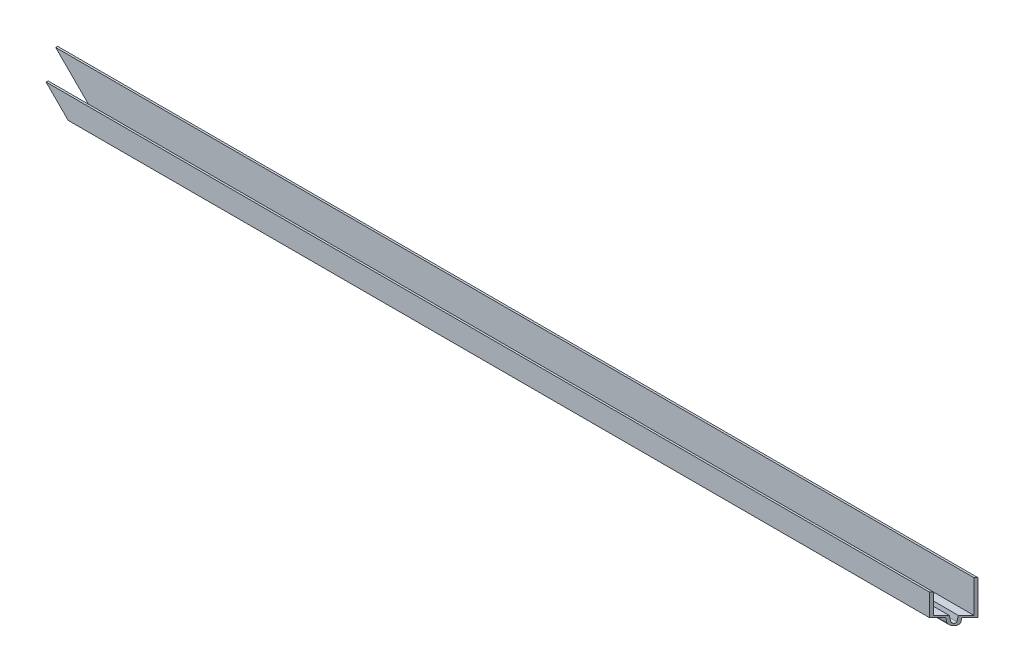
ISO-10303-21;
HEADER;
FILE_DESCRIPTION(('STEP AP214'),'2;1');
FILE_NAME('part.step','',(''),(''),'','','');
FILE_SCHEMA(('AUTOMOTIVE_DESIGN { 1 0 10303 214 1 1 1 1 }'));
ENDSEC;
DATA;
#1=APPLICATION_CONTEXT('core data for automotive mechanical design processes');
#2=APPLICATION_PROTOCOL_DEFINITION('international standard','automotive_design',2000,#1);
#3=PRODUCT_CONTEXT('',#1,'mechanical');
#4=PRODUCT('Part','Part','',(#3));
#5=PRODUCT_RELATED_PRODUCT_CATEGORY('part','',(#4));
#6=PRODUCT_DEFINITION_FORMATION('','',#4);
#7=PRODUCT_DEFINITION_CONTEXT('part definition',#1,'design');
#8=PRODUCT_DEFINITION('design','',#6,#7);
#9=PRODUCT_DEFINITION_SHAPE('','',#8);
#10=(LENGTH_UNIT() NAMED_UNIT(*) SI_UNIT(.MILLI.,.METRE.));
#11=(NAMED_UNIT(*) PLANE_ANGLE_UNIT() SI_UNIT($,.RADIAN.));
#12=(NAMED_UNIT(*) SI_UNIT($,.STERADIAN.) SOLID_ANGLE_UNIT());
#13=UNCERTAINTY_MEASURE_WITH_UNIT(LENGTH_MEASURE(1.E-05),#10,'distance_accuracy_value','');
#14=(GEOMETRIC_REPRESENTATION_CONTEXT(3) GLOBAL_UNCERTAINTY_ASSIGNED_CONTEXT((#13)) GLOBAL_UNIT_ASSIGNED_CONTEXT((#10,
#11,#12)) REPRESENTATION_CONTEXT('',''));
#15=CARTESIAN_POINT('',(0.,0.,0.));
#16=DIRECTION('',(0.,0.,1.));
#17=DIRECTION('',(1.,0.,0.));
#18=AXIS2_PLACEMENT_3D('',#15,#16,#17);
#19=CARTESIAN_POINT('',(289.71875,0.,-7.62));
#20=DIRECTION('',(0.,-1.,0.));
#21=DIRECTION('',(0.,0.,-1.));
#22=AXIS2_PLACEMENT_3D('',#19,#20,#21);
#23=PLANE('',#22);
#24=DIRECTION('',(-1.,0.,0.));
#25=VECTOR('',#24,1.);
#26=CARTESIAN_POINT('',(289.71875,0.,-6.35));
#27=LINE('',#26,#25);
#28=CARTESIAN_POINT('',(288.44875,0.,-6.35));
#29=VERTEX_POINT('',#28);
#30=CARTESIAN_POINT('',(-289.71875,0.,-6.35));
#31=VERTEX_POINT('',#30);
#32=EDGE_CURVE('E11',#29,#31,#27,.T.);
#33=ORIENTED_EDGE('',*,*,#32,.F.);
#34=DIRECTION('',(-0.707106781186547,0.,0.707106781186548));
#35=VECTOR('',#34,1.);
#36=CARTESIAN_POINT('',(289.71875,0.,-7.62));
#37=LINE('',#36,#35);
#38=CARTESIAN_POINT('',(289.71875,0.,-7.62));
#39=VERTEX_POINT('',#38);
#40=EDGE_CURVE('E176',#39,#29,#37,.T.);
#41=ORIENTED_EDGE('',*,*,#40,.F.);
#42=DIRECTION('',(-1.,0.,0.));
#43=VECTOR('',#42,1.);
#44=CARTESIAN_POINT('',(289.71875,0.,-7.62));
#45=LINE('',#44,#43);
#46=CARTESIAN_POINT('',(-289.71875,0.,-7.62));
#47=VERTEX_POINT('',#46);
#48=EDGE_CURVE('E170',#39,#47,#45,.T.);
#49=ORIENTED_EDGE('',*,*,#48,.T.);
#50=DIRECTION('',(0.,0.,1.));
#51=VECTOR('',#50,1.);
#52=CARTESIAN_POINT('',(-289.71875,0.,-7.62));
#53=LINE('',#52,#51);
#54=EDGE_CURVE('E152',#47,#31,#53,.T.);
#55=ORIENTED_EDGE('',*,*,#54,.T.);
#56=EDGE_LOOP('',(#33,#41,#49,#55));
#57=FACE_BOUND('',#56,.T.);
#58=ADVANCED_FACE('F45',(#57),#23,.F.);
#59=CARTESIAN_POINT('',(289.71875,0.,-6.35));
#60=DIRECTION('',(0.,0.,-1.));
#61=DIRECTION('',(-1.,0.,0.));
#62=AXIS2_PLACEMENT_3D('',#59,#60,#61);
#63=PLANE('',#62);
#64=ORIENTED_EDGE('',*,*,#32,.T.);
#65=DIRECTION('',(0.707106781186549,-0.707106781186546,0.));
#66=VECTOR('',#65,1.);
#67=CARTESIAN_POINT('',(8.88178419700125E-13,-289.71875,-6.35));
#68=LINE('',#67,#66);
#69=CARTESIAN_POINT('',(-269.14475,-20.574,-6.35));
#70=VERTEX_POINT('',#69);
#71=EDGE_CURVE('E158',#31,#70,#68,.T.);
#72=ORIENTED_EDGE('',*,*,#71,.T.);
#73=DIRECTION('',(-1.,0.,0.));
#74=VECTOR('',#73,1.);
#75=CARTESIAN_POINT('',(289.71875,-20.574,-6.35));
#76=LINE('',#75,#74);
#77=CARTESIAN_POINT('',(288.44875,-20.574,-6.35));
#78=VERTEX_POINT('',#77);
#79=EDGE_CURVE('E53',#78,#70,#76,.T.);
#80=ORIENTED_EDGE('',*,*,#79,.F.);
#81=DIRECTION('',(0.,1.,0.));
#82=VECTOR('',#81,1.);
#83=CARTESIAN_POINT('',(288.44875,0.,-6.35));
#84=LINE('',#83,#82);
#85=EDGE_CURVE('E163',#78,#29,#84,.T.);
#86=ORIENTED_EDGE('',*,*,#85,.T.);
#87=EDGE_LOOP('',(#64,#72,#80,#86));
#88=FACE_BOUND('',#87,.T.);
#89=ADVANCED_FACE('F227',(#88),#63,.F.);
#90=CARTESIAN_POINT('',(289.71875,-20.574,-6.35));
#91=DIRECTION('',(0.,-1.,0.));
#92=DIRECTION('',(0.,0.,-1.));
#93=AXIS2_PLACEMENT_3D('',#90,#91,#92);
#94=PLANE('',#93);
#95=ORIENTED_EDGE('',*,*,#79,.T.);
#96=DIRECTION('',(0.,0.,1.));
#97=VECTOR('',#96,1.);
#98=CARTESIAN_POINT('',(-269.14475,-20.574,-6.34999999999961));
#99=LINE('',#98,#97);
#100=CARTESIAN_POINT('',(-269.14475,-20.574,-1.4360058429734));
#101=VERTEX_POINT('',#100);
#102=EDGE_CURVE('E223',#70,#101,#99,.T.);
#103=ORIENTED_EDGE('',*,*,#102,.T.);
#104=DIRECTION('',(-1.,0.,0.));
#105=VECTOR('',#104,1.);
#106=CARTESIAN_POINT('',(289.71875,-20.574,-1.4360058429734));
#107=LINE('',#106,#105);
#108=CARTESIAN_POINT('',(283.534755842973,-20.574,-1.4360058429734));
#109=VERTEX_POINT('',#108);
#110=EDGE_CURVE('E214',#109,#101,#107,.T.);
#111=ORIENTED_EDGE('',*,*,#110,.F.);
#112=DIRECTION('',(0.707106781186547,0.,-0.707106781186548));
#113=VECTOR('',#112,1.);
#114=CARTESIAN_POINT('',(289.08375,-20.574,-6.985));
#115=LINE('',#114,#113);
#116=EDGE_CURVE('E224',#109,#78,#115,.T.);
#117=ORIENTED_EDGE('',*,*,#116,.T.);
#118=EDGE_LOOP('',(#95,#103,#111,#117));
#119=FACE_BOUND('',#118,.T.);
#120=ADVANCED_FACE('F221',(#119),#94,.F.);
#121=CARTESIAN_POINT('',(289.71875,-24.0709187171227,-0.944545967582546));
#122=DIRECTION('',(0.,-0.139173100960069,-0.99026806874157));
#123=DIRECTION('',(0.,0.99026806874157,-0.139173100960069));
#124=AXIS2_PLACEMENT_3D('',#121,#122,#123);
#125=PLANE('',#124);
#126=ORIENTED_EDGE('',*,*,#110,.T.);
#127=DIRECTION('',(0.703640787534027,-0.703640787534025,0.0988902636106828));
#128=VECTOR('',#127,1.);
#129=CARTESIAN_POINT('',(9.31991553151679,-299.038665531516,37.6996506859492));
#130=LINE('',#129,#128);
#131=CARTESIAN_POINT('',(-265.647831282877,-24.0709187171227,-0.944545967582547));
#132=VERTEX_POINT('',#131);
#133=EDGE_CURVE('E231',#101,#132,#130,.T.);
#134=ORIENTED_EDGE('',*,*,#133,.T.);
#135=DIRECTION('',(-1.,0.,0.));
#136=VECTOR('',#135,1.);
#137=CARTESIAN_POINT('',(289.71875,-24.0709187171227,-0.944545967582547));
#138=LINE('',#137,#136);
#139=CARTESIAN_POINT('',(283.043295967583,-24.0709187171227,-0.944545967582547));
#140=VERTEX_POINT('',#139);
#141=EDGE_CURVE('E211',#140,#132,#138,.T.);
#142=ORIENTED_EDGE('',*,*,#141,.F.);
#143=DIRECTION('',(0.137844537491632,0.980814848463988,-0.137844537491632));
#144=VECTOR('',#143,1.);
#145=CARTESIAN_POINT('',(283.170137047452,-23.168397537868,-1.07138704745159));
#146=LINE('',#145,#144);
#147=EDGE_CURVE('E264',#140,#109,#146,.T.);
#148=ORIENTED_EDGE('',*,*,#147,.T.);
#149=EDGE_LOOP('',(#126,#134,#142,#148));
#150=FACE_BOUND('',#149,.T.);
#151=ADVANCED_FACE('F270',(#150),#125,.F.);
#152=CARTESIAN_POINT('',(289.71875,-23.9381714384239,0.));
#153=DIRECTION('',(-1.,0.,0.));
#154=DIRECTION('',(0.,0.,1.));
#155=AXIS2_PLACEMENT_3D('',#152,#153,#154);
#156=CYLINDRICAL_SURFACE('',#155,0.95382856157613);
#157=ORIENTED_EDGE('',*,*,#141,.T.);
#158=CARTESIAN_POINT('',(-265.780578561576,-23.9381714384239,0.));
#159=DIRECTION('',(0.707106781186546,0.707106781186549,0.));
#160=DIRECTION('',(-0.707106781186549,0.707106781186546,0.));
#161=AXIS2_PLACEMENT_3D('',#158,#159,#160);
#162=ELLIPSE('',#161,1.34891728795979,0.95382856157613);
#163=CARTESIAN_POINT('',(-265.647831282877,-24.0709187171227,0.94454596758254));
#164=VERTEX_POINT('',#163);
#165=EDGE_CURVE('E277',#132,#164,#162,.F.);
#166=ORIENTED_EDGE('',*,*,#165,.T.);
#167=DIRECTION('',(-1.,0.,0.));
#168=VECTOR('',#167,1.);
#169=CARTESIAN_POINT('',(289.71875,-24.0709187171227,0.944545967582541));
#170=LINE('',#169,#168);
#171=CARTESIAN_POINT('',(281.154204032417,-24.0709187171227,0.944545967582541));
#172=VERTEX_POINT('',#171);
#173=EDGE_CURVE('E208',#172,#164,#170,.T.);
#174=ORIENTED_EDGE('',*,*,#173,.F.);
#175=CARTESIAN_POINT('',(282.09875,-23.9381714384239,0.));
#176=DIRECTION('',(-0.707106781186548,0.,-0.707106781186547));
#177=DIRECTION('',(-0.707106781186547,0.,0.707106781186548));
#178=AXIS2_PLACEMENT_3D('',#175,#176,#177);
#179=ELLIPSE('',#178,1.34891728795978,0.95382856157613);
#180=EDGE_CURVE('E261',#172,#140,#179,.F.);
#181=ORIENTED_EDGE('',*,*,#180,.T.);
#182=EDGE_LOOP('',(#157,#166,#174,#181));
#183=FACE_BOUND('',#182,.T.);
#184=ADVANCED_FACE('F275',(#183),#156,.F.);
#185=CARTESIAN_POINT('',(289.71875,-20.574,1.43600584297339));
#186=DIRECTION('',(0.,-0.139173100960069,0.99026806874157));
#187=DIRECTION('',(0.,-0.99026806874157,-0.139173100960069));
#188=AXIS2_PLACEMENT_3D('',#185,#186,#187);
#189=PLANE('',#188);
#190=ORIENTED_EDGE('',*,*,#173,.T.);
#191=DIRECTION('',(-0.703640787534027,0.703640787534025,0.0988902636106826));
#192=VECTOR('',#191,1.);
#193=CARTESIAN_POINT('',(7.55435749191125,-297.27310749191,-37.4515176853475));
#194=LINE('',#193,#192);
#195=CARTESIAN_POINT('',(-269.14475,-20.574,1.43600584297339));
#196=VERTEX_POINT('',#195);
#197=EDGE_CURVE('E282',#164,#196,#194,.T.);
#198=ORIENTED_EDGE('',*,*,#197,.T.);
#199=DIRECTION('',(-1.,0.,0.));
#200=VECTOR('',#199,1.);
#201=CARTESIAN_POINT('',(289.71875,-20.574,1.43600584297339));
#202=LINE('',#201,#200);
#203=CARTESIAN_POINT('',(280.662744157027,-20.574,1.43600584297339));
#204=VERTEX_POINT('',#203);
#205=EDGE_CURVE('E205',#204,#196,#202,.T.);
#206=ORIENTED_EDGE('',*,*,#205,.F.);
#207=DIRECTION('',(0.137844537491632,-0.980814848463988,-0.137844537491632));
#208=VECTOR('',#207,1.);
#209=CARTESIAN_POINT('',(280.834818379221,-21.7983717106053,1.26393162077893));
#210=LINE('',#209,#208);
#211=EDGE_CURVE('E258',#204,#172,#210,.T.);
#212=ORIENTED_EDGE('',*,*,#211,.T.);
#213=EDGE_LOOP('',(#190,#198,#206,#212));
#214=FACE_BOUND('',#213,.T.);
#215=ADVANCED_FACE('F280',(#214),#189,.F.);
#216=CARTESIAN_POINT('',(289.71875,-20.574,1.43600584297339));
#217=DIRECTION('',(0.,-1.,0.));
#218=DIRECTION('',(0.,0.,-1.));
#219=AXIS2_PLACEMENT_3D('',#216,#217,#218);
#220=PLANE('',#219);
#221=ORIENTED_EDGE('',*,*,#205,.T.);
#222=DIRECTION('',(0.,0.,1.));
#223=VECTOR('',#222,1.);
#224=CARTESIAN_POINT('',(-269.14475,-20.574,1.436005842973));
#225=LINE('',#224,#223);
#226=CARTESIAN_POINT('',(-269.14475,-20.574,6.35));
#227=VERTEX_POINT('',#226);
#228=EDGE_CURVE('E287',#196,#227,#225,.T.);
#229=ORIENTED_EDGE('',*,*,#228,.T.);
#230=DIRECTION('',(-1.,0.,0.));
#231=VECTOR('',#230,1.);
#232=CARTESIAN_POINT('',(289.71875,-20.574,6.35));
#233=LINE('',#232,#231);
#234=CARTESIAN_POINT('',(275.74875,-20.574,6.35));
#235=VERTEX_POINT('',#234);
#236=EDGE_CURVE('E202',#235,#227,#233,.T.);
#237=ORIENTED_EDGE('',*,*,#236,.F.);
#238=DIRECTION('',(0.707106781186547,0.,-0.707106781186548));
#239=VECTOR('',#238,1.);
#240=CARTESIAN_POINT('',(285.190747078513,-20.574,-3.09199707851329));
#241=LINE('',#240,#239);
#242=EDGE_CURVE('E255',#235,#204,#241,.T.);
#243=ORIENTED_EDGE('',*,*,#242,.T.);
#244=EDGE_LOOP('',(#221,#229,#237,#243));
#245=FACE_BOUND('',#244,.T.);
#246=ADVANCED_FACE('F285',(#245),#220,.F.);
#247=CARTESIAN_POINT('',(289.71875,-20.574,6.35));
#248=DIRECTION('',(0.,0.,1.));
#249=DIRECTION('',(0.,-1.,0.));
#250=AXIS2_PLACEMENT_3D('',#247,#248,#249);
#251=PLANE('',#250);
#252=ORIENTED_EDGE('',*,*,#236,.T.);
#253=DIRECTION('',(-0.707106781186549,0.707106781186546,0.));
#254=VECTOR('',#253,1.);
#255=CARTESIAN_POINT('',(10.2870000000009,-300.00575,6.34999999999996));
#256=LINE('',#255,#254);
#257=CARTESIAN_POINT('',(-281.84475,-7.874,6.35));
#258=VERTEX_POINT('',#257);
#259=EDGE_CURVE('E292',#227,#258,#256,.T.);
#260=ORIENTED_EDGE('',*,*,#259,.T.);
#261=DIRECTION('',(-1.,0.,0.));
#262=VECTOR('',#261,1.);
#263=CARTESIAN_POINT('',(289.71875,-7.874,6.35));
#264=LINE('',#263,#262);
#265=CARTESIAN_POINT('',(275.74875,-7.874,6.35));
#266=VERTEX_POINT('',#265);
#267=EDGE_CURVE('E199',#266,#258,#264,.T.);
#268=ORIENTED_EDGE('',*,*,#267,.F.);
#269=DIRECTION('',(0.,-1.,0.));
#270=VECTOR('',#269,1.);
#271=CARTESIAN_POINT('',(275.74875,-20.574,6.35));
#272=LINE('',#271,#270);
#273=EDGE_CURVE('E252',#266,#235,#272,.T.);
#274=ORIENTED_EDGE('',*,*,#273,.T.);
#275=EDGE_LOOP('',(#252,#260,#268,#274));
#276=FACE_BOUND('',#275,.T.);
#277=ADVANCED_FACE('F290',(#276),#251,.F.);
#278=CARTESIAN_POINT('',(289.71875,-7.874,7.62));
#279=DIRECTION('',(0.,-1.,0.));
#280=DIRECTION('',(0.,0.,-1.));
#281=AXIS2_PLACEMENT_3D('',#278,#279,#280);
#282=PLANE('',#281);
#283=ORIENTED_EDGE('',*,*,#267,.T.);
#284=DIRECTION('',(0.,0.,1.));
#285=VECTOR('',#284,1.);
#286=CARTESIAN_POINT('',(-281.84475,-7.874,7.62));
#287=LINE('',#286,#285);
#288=CARTESIAN_POINT('',(-281.84475,-7.87400000000006,7.62));
#289=VERTEX_POINT('',#288);
#290=EDGE_CURVE('E297',#258,#289,#287,.T.);
#291=ORIENTED_EDGE('',*,*,#290,.T.);
#292=DIRECTION('',(-1.,0.,0.));
#293=VECTOR('',#292,1.);
#294=CARTESIAN_POINT('',(289.71875,-7.874,7.62));
#295=LINE('',#294,#293);
#296=CARTESIAN_POINT('',(274.47875,-7.874,7.62));
#297=VERTEX_POINT('',#296);
#298=EDGE_CURVE('E196',#297,#289,#295,.T.);
#299=ORIENTED_EDGE('',*,*,#298,.F.);
#300=DIRECTION('',(0.707106781186547,0.,-0.707106781186548));
#301=VECTOR('',#300,1.);
#302=CARTESIAN_POINT('',(282.09875,-7.874,0.));
#303=LINE('',#302,#301);
#304=EDGE_CURVE('E249',#297,#266,#303,.T.);
#305=ORIENTED_EDGE('',*,*,#304,.T.);
#306=EDGE_LOOP('',(#283,#291,#299,#305));
#307=FACE_BOUND('',#306,.T.);
#308=ADVANCED_FACE('F295',(#307),#282,.F.);
#309=CARTESIAN_POINT('',(289.71875,-21.844,7.62));
#310=DIRECTION('',(0.,0.,-1.));
#311=DIRECTION('',(-1.,0.,0.));
#312=AXIS2_PLACEMENT_3D('',#309,#310,#311);
#313=PLANE('',#312);
#314=ORIENTED_EDGE('',*,*,#298,.T.);
#315=DIRECTION('',(-0.707106781186549,0.707106781186546,0.));
#316=VECTOR('',#315,1.);
#317=CARTESIAN_POINT('',(-289.71875,0.,7.62));
#318=LINE('',#317,#316);
#319=CARTESIAN_POINT('',(-267.87475,-21.844,7.62));
#320=VERTEX_POINT('',#319);
#321=EDGE_CURVE('E173',#320,#289,#318,.T.);
#322=ORIENTED_EDGE('',*,*,#321,.F.);
#323=DIRECTION('',(-1.,0.,0.));
#324=VECTOR('',#323,1.);
#325=CARTESIAN_POINT('',(289.71875,-21.844,7.62));
#326=LINE('',#325,#324);
#327=CARTESIAN_POINT('',(274.47875,-21.844,7.62));
#328=VERTEX_POINT('',#327);
#329=EDGE_CURVE('E193',#328,#320,#326,.T.);
#330=ORIENTED_EDGE('',*,*,#329,.F.);
#331=DIRECTION('',(0.,1.,0.));
#332=VECTOR('',#331,1.);
#333=CARTESIAN_POINT('',(274.47875,-26.162,7.62));
#334=LINE('',#333,#332);
#335=EDGE_CURVE('E229',#328,#297,#334,.T.);
#336=ORIENTED_EDGE('',*,*,#335,.T.);
#337=EDGE_LOOP('',(#314,#322,#330,#336));
#338=FACE_BOUND('',#337,.T.);
#339=ADVANCED_FACE('F300',(#338),#313,.F.);
#340=CARTESIAN_POINT('',(289.71875,-21.844,2.54));
#341=DIRECTION('',(0.,1.,0.));
#342=DIRECTION('',(0.,0.,1.));
#343=AXIS2_PLACEMENT_3D('',#340,#341,#342);
#344=PLANE('',#343);
#345=ORIENTED_EDGE('',*,*,#329,.T.);
#346=DIRECTION('',(0.,0.,-1.));
#347=VECTOR('',#346,1.);
#348=CARTESIAN_POINT('',(-267.87475,-21.844,2.53999999999962));
#349=LINE('',#348,#347);
#350=CARTESIAN_POINT('',(-267.87475,-21.844,2.53999999999999));
#351=VERTEX_POINT('',#350);
#352=EDGE_CURVE('E307',#320,#351,#349,.T.);
#353=ORIENTED_EDGE('',*,*,#352,.T.);
#354=DIRECTION('',(-1.,0.,0.));
#355=VECTOR('',#354,1.);
#356=CARTESIAN_POINT('',(289.71875,-21.844,2.54));
#357=LINE('',#356,#355);
#358=CARTESIAN_POINT('',(279.55875,-21.844,2.54));
#359=VERTEX_POINT('',#358);
#360=EDGE_CURVE('E190',#359,#351,#357,.T.);
#361=ORIENTED_EDGE('',*,*,#360,.F.);
#362=DIRECTION('',(-0.707106781186547,0.,0.707106781186548));
#363=VECTOR('',#362,1.);
#364=CARTESIAN_POINT('',(284.63875,-21.844,-2.53999999999999));
#365=LINE('',#364,#363);
#366=EDGE_CURVE('E246',#359,#328,#365,.T.);
#367=ORIENTED_EDGE('',*,*,#366,.T.);
#368=EDGE_LOOP('',(#345,#353,#361,#367));
#369=FACE_BOUND('',#368,.T.);
#370=ADVANCED_FACE('F305',(#369),#344,.F.);
#371=CARTESIAN_POINT('',(289.71875,-21.844,2.54));
#372=DIRECTION('',(0.,0.13917310096007,-0.99026806874157));
#373=DIRECTION('',(0.,0.99026806874157,0.13917310096007));
#374=AXIS2_PLACEMENT_3D('',#371,#372,#373);
#375=PLANE('',#374);
#376=ORIENTED_EDGE('',*,*,#360,.T.);
#377=DIRECTION('',(0.703640787534027,-0.703640787534025,-0.098890263610683));
#378=VECTOR('',#377,1.);
#379=CARTESIAN_POINT('',(8.19556733740168,-297.914317337401,-36.2591528351536));
#380=LINE('',#379,#378);
#381=CARTESIAN_POINT('',(-265.471081444658,-24.247668555342,2.20218641488433));
#382=VERTEX_POINT('',#381);
#383=EDGE_CURVE('E312',#351,#382,#380,.T.);
#384=ORIENTED_EDGE('',*,*,#383,.T.);
#385=DIRECTION('',(-1.,0.,0.));
#386=VECTOR('',#385,1.);
#387=CARTESIAN_POINT('',(289.71875,-24.247668555342,2.20218641488433));
#388=LINE('',#387,#386);
#389=CARTESIAN_POINT('',(279.896563585116,-24.247668555342,2.20218641488433));
#390=VERTEX_POINT('',#389);
#391=EDGE_CURVE('E187',#390,#382,#388,.T.);
#392=ORIENTED_EDGE('',*,*,#391,.F.);
#393=DIRECTION('',(-0.137844537491632,0.980814848463988,0.137844537491633));
#394=VECTOR('',#393,1.);
#395=CARTESIAN_POINT('',(279.751801343805,-23.2176316865787,2.34694865619457));
#396=LINE('',#395,#394);
#397=EDGE_CURVE('E243',#390,#359,#396,.T.);
#398=ORIENTED_EDGE('',*,*,#397,.T.);
#399=EDGE_LOOP('',(#376,#384,#392,#398));
#400=FACE_BOUND('',#399,.T.);
#401=ADVANCED_FACE('F310',(#400),#375,.F.);
#402=CARTESIAN_POINT('',(289.71875,-23.9381714384239,0.));
#403=DIRECTION('',(-1.,0.,0.));
#404=DIRECTION('',(0.,0.,1.));
#405=AXIS2_PLACEMENT_3D('',#402,#403,#404);
#406=CYLINDRICAL_SURFACE('',#405,2.22382856157613);
#407=CARTESIAN_POINT('',(-265.780578561576,-23.9381714384239,0.));
#408=DIRECTION('',(0.707106781186546,0.707106781186549,0.));
#409=DIRECTION('',(-0.707106781186549,0.707106781186546,0.));
#410=AXIS2_PLACEMENT_3D('',#407,#408,#409);
#411=ELLIPSE('',#410,3.14496851217362,2.22382856157613);
#412=CARTESIAN_POINT('',(-265.471081444658,-24.247668555342,-2.20218641488433));
#413=VERTEX_POINT('',#412);
#414=EDGE_CURVE('E320',#382,#413,#411,.T.);
#415=ORIENTED_EDGE('',*,*,#414,.T.);
#416=DIRECTION('',(-1.,0.,0.));
#417=VECTOR('',#416,1.);
#418=CARTESIAN_POINT('',(289.71875,-24.247668555342,-2.20218641488434));
#419=LINE('',#418,#417);
#420=CARTESIAN_POINT('',(284.300936414884,-24.247668555342,-2.20218641488434));
#421=VERTEX_POINT('',#420);
#422=EDGE_CURVE('E184',#421,#413,#419,.T.);
#423=ORIENTED_EDGE('',*,*,#422,.F.);
#424=CARTESIAN_POINT('',(282.09875,-23.9381714384239,0.));
#425=DIRECTION('',(-0.707106781186548,0.,-0.707106781186547));
#426=DIRECTION('',(-0.707106781186547,0.,0.707106781186548));
#427=AXIS2_PLACEMENT_3D('',#424,#425,#426);
#428=ELLIPSE('',#427,3.14496851217361,2.22382856157613);
#429=EDGE_CURVE('E241',#421,#390,#428,.T.);
#430=ORIENTED_EDGE('',*,*,#429,.T.);
#431=ORIENTED_EDGE('',*,*,#391,.T.);
#432=EDGE_LOOP('',(#415,#423,#430,#431));
#433=FACE_BOUND('',#432,.T.);
#434=ADVANCED_FACE('F319',(#433),#406,.T.);
#435=CARTESIAN_POINT('',(289.71875,-24.247668555342,-2.20218641488434));
#436=DIRECTION('',(0.,0.139173100960069,0.99026806874157));
#437=DIRECTION('',(0.,-0.99026806874157,0.139173100960069));
#438=AXIS2_PLACEMENT_3D('',#435,#436,#437);
#439=PLANE('',#438);
#440=ORIENTED_EDGE('',*,*,#422,.T.);
#441=DIRECTION('',(-0.703640787534027,0.703640787534025,-0.0988902636106828));
#442=VECTOR('',#441,1.);
#443=CARTESIAN_POINT('',(9.40915469407977,-299.127904694079,36.4297114152453));
#444=LINE('',#443,#442);
#445=CARTESIAN_POINT('',(-267.87475,-21.844,-2.54));
#446=VERTEX_POINT('',#445);
#447=EDGE_CURVE('E322',#413,#446,#444,.T.);
#448=ORIENTED_EDGE('',*,*,#447,.T.);
#449=DIRECTION('',(-1.,0.,0.));
#450=VECTOR('',#449,1.);
#451=CARTESIAN_POINT('',(289.71875,-21.844,-2.54));
#452=LINE('',#451,#450);
#453=CARTESIAN_POINT('',(284.63875,-21.844,-2.54));
#454=VERTEX_POINT('',#453);
#455=EDGE_CURVE('E178',#454,#446,#452,.T.);
#456=ORIENTED_EDGE('',*,*,#455,.F.);
#457=DIRECTION('',(-0.137844537491632,-0.980814848463988,0.137844537491632));
#458=VECTOR('',#457,1.);
#459=CARTESIAN_POINT('',(284.403880922079,-23.5151803257661,-2.30513092207862));
#460=LINE('',#459,#458);
#461=EDGE_CURVE('E238',#454,#421,#460,.T.);
#462=ORIENTED_EDGE('',*,*,#461,.T.);
#463=EDGE_LOOP('',(#440,#448,#456,#462));
#464=FACE_BOUND('',#463,.T.);
#465=ADVANCED_FACE('F317',(#464),#439,.F.);
#466=CARTESIAN_POINT('',(289.71875,-21.844,-7.62));
#467=DIRECTION('',(0.,1.,0.));
#468=DIRECTION('',(0.,0.,1.));
#469=AXIS2_PLACEMENT_3D('',#466,#467,#468);
#470=PLANE('',#469);
#471=ORIENTED_EDGE('',*,*,#455,.T.);
#472=DIRECTION('',(0.,0.,-1.));
#473=VECTOR('',#472,1.);
#474=CARTESIAN_POINT('',(-267.87475,-21.844,-7.61999999999962));
#475=LINE('',#474,#473);
#476=CARTESIAN_POINT('',(-267.87475,-21.844,-7.62));
#477=VERTEX_POINT('',#476);
#478=EDGE_CURVE('E172',#446,#477,#475,.T.);
#479=ORIENTED_EDGE('',*,*,#478,.T.);
#480=DIRECTION('',(-1.,0.,0.));
#481=VECTOR('',#480,1.);
#482=CARTESIAN_POINT('',(289.71875,-21.844,-7.62));
#483=LINE('',#482,#481);
#484=CARTESIAN_POINT('',(289.71875,-21.844,-7.62));
#485=VERTEX_POINT('',#484);
#486=EDGE_CURVE('E171',#485,#477,#483,.T.);
#487=ORIENTED_EDGE('',*,*,#486,.F.);
#488=DIRECTION('',(-0.707106781186547,0.,0.707106781186548));
#489=VECTOR('',#488,1.);
#490=CARTESIAN_POINT('',(289.71875,-21.844,-7.62));
#491=LINE('',#490,#489);
#492=EDGE_CURVE('E59',#485,#454,#491,.T.);
#493=ORIENTED_EDGE('',*,*,#492,.T.);
#494=EDGE_LOOP('',(#471,#479,#487,#493));
#495=FACE_BOUND('',#494,.T.);
#496=ADVANCED_FACE('F335',(#495),#470,.F.);
#497=CARTESIAN_POINT('',(289.71875,0.,-7.62));
#498=DIRECTION('',(0.,0.,1.));
#499=DIRECTION('',(0.,-1.,0.));
#500=AXIS2_PLACEMENT_3D('',#497,#498,#499);
#501=PLANE('',#500);
#502=ORIENTED_EDGE('',*,*,#486,.T.);
#503=DIRECTION('',(-0.707106781186549,0.707106781186546,0.));
#504=VECTOR('',#503,1.);
#505=CARTESIAN_POINT('',(-289.71875,0.,-7.62));
#506=LINE('',#505,#504);
#507=EDGE_CURVE('E155',#477,#47,#506,.T.);
#508=ORIENTED_EDGE('',*,*,#507,.T.);
#509=ORIENTED_EDGE('',*,*,#48,.F.);
#510=DIRECTION('',(0.,1.,0.));
#511=VECTOR('',#510,1.);
#512=CARTESIAN_POINT('',(289.71875,0.,-7.62));
#513=LINE('',#512,#511);
#514=EDGE_CURVE('E162',#485,#39,#513,.T.);
#515=ORIENTED_EDGE('',*,*,#514,.F.);
#516=EDGE_LOOP('',(#502,#508,#509,#515));
#517=FACE_BOUND('',#516,.T.);
#518=ADVANCED_FACE('F168',(#517),#501,.F.);
#519=CARTESIAN_POINT('',(289.71875,-26.162,-7.62));
#520=DIRECTION('',(-0.707106781186548,0.,-0.707106781186547));
#521=DIRECTION('',(-0.707106781186547,0.,0.707106781186548));
#522=AXIS2_PLACEMENT_3D('',#519,#520,#521);
#523=PLANE('',#522);
#524=ORIENTED_EDGE('',*,*,#116,.F.);
#525=ORIENTED_EDGE('',*,*,#147,.F.);
#526=ORIENTED_EDGE('',*,*,#180,.F.);
#527=ORIENTED_EDGE('',*,*,#211,.F.);
#528=ORIENTED_EDGE('',*,*,#242,.F.);
#529=ORIENTED_EDGE('',*,*,#273,.F.);
#530=ORIENTED_EDGE('',*,*,#304,.F.);
#531=ORIENTED_EDGE('',*,*,#335,.F.);
#532=ORIENTED_EDGE('',*,*,#366,.F.);
#533=ORIENTED_EDGE('',*,*,#397,.F.);
#534=ORIENTED_EDGE('',*,*,#429,.F.);
#535=ORIENTED_EDGE('',*,*,#461,.F.);
#536=ORIENTED_EDGE('',*,*,#492,.F.);
#537=ORIENTED_EDGE('',*,*,#514,.T.);
#538=ORIENTED_EDGE('',*,*,#40,.T.);
#539=ORIENTED_EDGE('',*,*,#85,.F.);
#540=EDGE_LOOP('',(#524,#525,#526,#527,#528,#529,#530,#531,#532,#533,#534,#535,#536,#537,#538,#539));
#541=FACE_BOUND('',#540,.T.);
#542=ADVANCED_FACE('F272',(#541),#523,.F.);
#543=CARTESIAN_POINT('',(-289.71875,0.,-7.62));
#544=DIRECTION('',(0.707106781186546,0.707106781186549,0.));
#545=DIRECTION('',(-0.707106781186549,0.707106781186546,0.));
#546=AXIS2_PLACEMENT_3D('',#543,#544,#545);
#547=PLANE('',#546);
#548=ORIENTED_EDGE('',*,*,#54,.F.);
#549=ORIENTED_EDGE('',*,*,#507,.F.);
#550=ORIENTED_EDGE('',*,*,#478,.F.);
#551=ORIENTED_EDGE('',*,*,#447,.F.);
#552=ORIENTED_EDGE('',*,*,#414,.F.);
#553=ORIENTED_EDGE('',*,*,#383,.F.);
#554=ORIENTED_EDGE('',*,*,#352,.F.);
#555=ORIENTED_EDGE('',*,*,#321,.T.);
#556=ORIENTED_EDGE('',*,*,#290,.F.);
#557=ORIENTED_EDGE('',*,*,#259,.F.);
#558=ORIENTED_EDGE('',*,*,#228,.F.);
#559=ORIENTED_EDGE('',*,*,#197,.F.);
#560=ORIENTED_EDGE('',*,*,#165,.F.);
#561=ORIENTED_EDGE('',*,*,#133,.F.);
#562=ORIENTED_EDGE('',*,*,#102,.F.);
#563=ORIENTED_EDGE('',*,*,#71,.F.);
#564=EDGE_LOOP('',(#548,#549,#550,#551,#552,#553,#554,#555,#556,#557,#558,#559,#560,#561,#562,#563));
#565=FACE_BOUND('',#564,.T.);
#566=ADVANCED_FACE('F154',(#565),#547,.F.);
#567=CLOSED_SHELL('',(#58,#89,#120,#151,#184,#215,#246,#277,#308,#339,#370,#401,#434,#465,#496,
#518,#542,#566));
#568=MANIFOLD_SOLID_BREP('B2',#567);
#569=ADVANCED_BREP_SHAPE_REPRESENTATION('',(#18,#568),#14);
#570=SHAPE_DEFINITION_REPRESENTATION(#9,#569);
ENDSEC;
END-ISO-10303-21;
